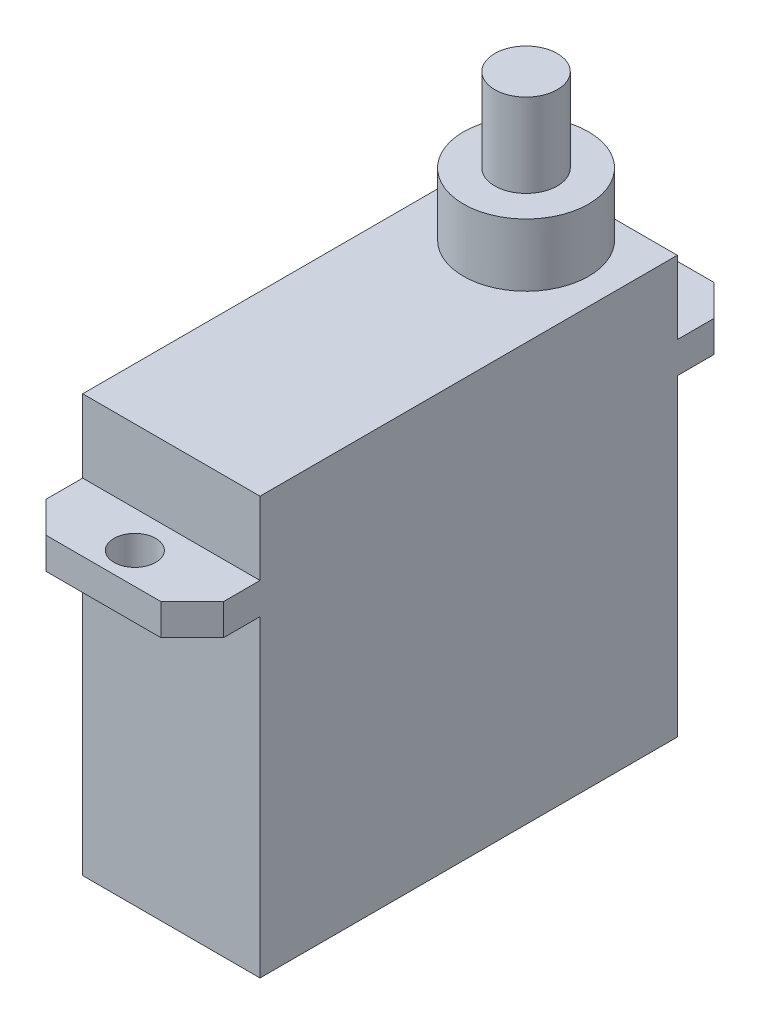
ISO-10303-21;
HEADER;
FILE_DESCRIPTION(('STEP AP214'),'2;1');
FILE_NAME('part.step','',(''),(''),'','','');
FILE_SCHEMA(('AUTOMOTIVE_DESIGN { 1 0 10303 214 1 1 1 1 }'));
ENDSEC;
DATA;
#1=APPLICATION_CONTEXT('core data for automotive mechanical design processes');
#2=APPLICATION_PROTOCOL_DEFINITION('international standard','automotive_design',2000,#1);
#3=PRODUCT_CONTEXT('',#1,'mechanical');
#4=PRODUCT('Part','Part','',(#3));
#5=PRODUCT_RELATED_PRODUCT_CATEGORY('part','',(#4));
#6=PRODUCT_DEFINITION_FORMATION('','',#4);
#7=PRODUCT_DEFINITION_CONTEXT('part definition',#1,'design');
#8=PRODUCT_DEFINITION('design','',#6,#7);
#9=PRODUCT_DEFINITION_SHAPE('','',#8);
#10=(LENGTH_UNIT() NAMED_UNIT(*) SI_UNIT(.MILLI.,.METRE.));
#11=(NAMED_UNIT(*) PLANE_ANGLE_UNIT() SI_UNIT($,.RADIAN.));
#12=(NAMED_UNIT(*) SI_UNIT($,.STERADIAN.) SOLID_ANGLE_UNIT());
#13=UNCERTAINTY_MEASURE_WITH_UNIT(LENGTH_MEASURE(1.E-05),#10,'distance_accuracy_value','');
#14=(GEOMETRIC_REPRESENTATION_CONTEXT(3) GLOBAL_UNCERTAINTY_ASSIGNED_CONTEXT((#13)) GLOBAL_UNIT_ASSIGNED_CONTEXT((#10,
#11,#12)) REPRESENTATION_CONTEXT('',''));
#15=CARTESIAN_POINT('',(0.,0.,0.));
#16=DIRECTION('',(0.,0.,1.));
#17=DIRECTION('',(1.,0.,0.));
#18=AXIS2_PLACEMENT_3D('',#15,#16,#17);
#19=CARTESIAN_POINT('',(-4.25,20.,10.));
#20=DIRECTION('',(0.,0.,-1.));
#21=DIRECTION('',(-1.,0.,0.));
#22=AXIS2_PLACEMENT_3D('',#19,#20,#21);
#23=PLANE('',#22);
#24=DIRECTION('',(-1.,0.,0.));
#25=VECTOR('',#24,1.);
#26=CARTESIAN_POINT('',(-4.25,16.5,10.));
#27=LINE('',#26,#25);
#28=CARTESIAN_POINT('',(4.25,16.5,10.));
#29=VERTEX_POINT('',#28);
#30=CARTESIAN_POINT('',(-4.25,16.5,10.));
#31=VERTEX_POINT('',#30);
#32=EDGE_CURVE('E328',#29,#31,#27,.T.);
#33=ORIENTED_EDGE('',*,*,#32,.F.);
#34=DIRECTION('',(0.,-1.,0.));
#35=VECTOR('',#34,1.);
#36=CARTESIAN_POINT('',(4.25,20.,10.));
#37=LINE('',#36,#35);
#38=CARTESIAN_POINT('',(4.25,20.,10.));
#39=VERTEX_POINT('',#38);
#40=EDGE_CURVE('E197',#39,#29,#37,.T.);
#41=ORIENTED_EDGE('',*,*,#40,.F.);
#42=DIRECTION('',(1.,0.,0.));
#43=VECTOR('',#42,1.);
#44=CARTESIAN_POINT('',(-4.25,20.,10.));
#45=LINE('',#44,#43);
#46=CARTESIAN_POINT('',(-4.25,20.,10.));
#47=VERTEX_POINT('',#46);
#48=EDGE_CURVE('E184',#47,#39,#45,.T.);
#49=ORIENTED_EDGE('',*,*,#48,.F.);
#50=DIRECTION('',(0.,-1.,0.));
#51=VECTOR('',#50,1.);
#52=CARTESIAN_POINT('',(-4.25,20.,10.));
#53=LINE('',#52,#51);
#54=EDGE_CURVE('E201',#47,#31,#53,.T.);
#55=ORIENTED_EDGE('',*,*,#54,.T.);
#56=EDGE_LOOP('',(#33,#41,#49,#55));
#57=FACE_BOUND('',#56,.T.);
#58=ADVANCED_FACE('F46',(#57),#23,.F.);
#59=CARTESIAN_POINT('',(-4.25,20.,-10.));
#60=DIRECTION('',(0.,0.,1.));
#61=DIRECTION('',(1.,0.,0.));
#62=AXIS2_PLACEMENT_3D('',#59,#60,#61);
#63=PLANE('',#62);
#64=DIRECTION('',(1.,0.,0.));
#65=VECTOR('',#64,1.);
#66=CARTESIAN_POINT('',(-4.25,16.5,-10.));
#67=LINE('',#66,#65);
#68=CARTESIAN_POINT('',(-4.25,16.5,-10.));
#69=VERTEX_POINT('',#68);
#70=CARTESIAN_POINT('',(4.25,16.5,-10.));
#71=VERTEX_POINT('',#70);
#72=EDGE_CURVE('E263',#69,#71,#67,.T.);
#73=ORIENTED_EDGE('',*,*,#72,.F.);
#74=DIRECTION('',(0.,-1.,0.));
#75=VECTOR('',#74,1.);
#76=CARTESIAN_POINT('',(-4.25,20.,-10.));
#77=LINE('',#76,#75);
#78=CARTESIAN_POINT('',(-4.25,20.,-10.));
#79=VERTEX_POINT('',#78);
#80=EDGE_CURVE('E177',#79,#69,#77,.T.);
#81=ORIENTED_EDGE('',*,*,#80,.F.);
#82=DIRECTION('',(-1.,0.,0.));
#83=VECTOR('',#82,1.);
#84=CARTESIAN_POINT('',(-4.25,20.,-10.));
#85=LINE('',#84,#83);
#86=CARTESIAN_POINT('',(0.,20.,-10.));
#87=VERTEX_POINT('',#86);
#88=EDGE_CURVE('E172',#87,#79,#85,.T.);
#89=ORIENTED_EDGE('',*,*,#88,.F.);
#90=CARTESIAN_POINT('',(4.25,20.,-10.));
#91=VERTEX_POINT('',#90);
#92=EDGE_CURVE('E162',#91,#87,#85,.T.);
#93=ORIENTED_EDGE('',*,*,#92,.F.);
#94=DIRECTION('',(0.,-1.,0.));
#95=VECTOR('',#94,1.);
#96=CARTESIAN_POINT('',(4.25,20.,-10.));
#97=LINE('',#96,#95);
#98=EDGE_CURVE('E50',#91,#71,#97,.T.);
#99=ORIENTED_EDGE('',*,*,#98,.T.);
#100=EDGE_LOOP('',(#73,#81,#89,#93,#99));
#101=FACE_BOUND('',#100,.T.);
#102=ADVANCED_FACE('F175',(#101),#63,.F.);
#103=CARTESIAN_POINT('',(4.25,20.,10.));
#104=DIRECTION('',(-1.,0.,0.));
#105=DIRECTION('',(0.,0.,1.));
#106=AXIS2_PLACEMENT_3D('',#103,#104,#105);
#107=PLANE('',#106);
#108=DIRECTION('',(0.,0.,-1.));
#109=VECTOR('',#108,1.);
#110=CARTESIAN_POINT('',(4.25,0.,10.));
#111=LINE('',#110,#109);
#112=CARTESIAN_POINT('',(4.25,0.,10.));
#113=VERTEX_POINT('',#112);
#114=CARTESIAN_POINT('',(4.25,0.,-10.));
#115=VERTEX_POINT('',#114);
#116=EDGE_CURVE('E186',#113,#115,#111,.T.);
#117=ORIENTED_EDGE('',*,*,#116,.T.);
#118=CARTESIAN_POINT('',(4.25,15.,-10.));
#119=VERTEX_POINT('',#118);
#120=EDGE_CURVE('E203',#119,#115,#97,.T.);
#121=ORIENTED_EDGE('',*,*,#120,.F.);
#122=DIRECTION('',(0.,0.,-1.));
#123=VECTOR('',#122,1.);
#124=CARTESIAN_POINT('',(4.25,15.,-10.));
#125=LINE('',#124,#123);
#126=CARTESIAN_POINT('',(4.25,15.,-11.75));
#127=VERTEX_POINT('',#126);
#128=EDGE_CURVE('E279',#119,#127,#125,.T.);
#129=ORIENTED_EDGE('',*,*,#128,.T.);
#130=DIRECTION('',(0.,-1.,0.));
#131=VECTOR('',#130,1.);
#132=CARTESIAN_POINT('',(4.25,16.5,-11.75));
#133=LINE('',#132,#131);
#134=CARTESIAN_POINT('',(4.25,16.5,-11.75));
#135=VERTEX_POINT('',#134);
#136=EDGE_CURVE('E190',#135,#127,#133,.T.);
#137=ORIENTED_EDGE('',*,*,#136,.F.);
#138=DIRECTION('',(0.,0.,-1.));
#139=VECTOR('',#138,1.);
#140=CARTESIAN_POINT('',(4.25,16.5,-10.));
#141=LINE('',#140,#139);
#142=EDGE_CURVE('E267',#71,#135,#141,.T.);
#143=ORIENTED_EDGE('',*,*,#142,.F.);
#144=ORIENTED_EDGE('',*,*,#98,.F.);
#145=DIRECTION('',(0.,0.,-1.));
#146=VECTOR('',#145,1.);
#147=CARTESIAN_POINT('',(4.25,20.,10.));
#148=LINE('',#147,#146);
#149=EDGE_CURVE('E168',#39,#91,#148,.T.);
#150=ORIENTED_EDGE('',*,*,#149,.F.);
#151=ORIENTED_EDGE('',*,*,#40,.T.);
#152=DIRECTION('',(0.,0.,-1.));
#153=VECTOR('',#152,1.);
#154=CARTESIAN_POINT('',(4.25,16.5,10.));
#155=LINE('',#154,#153);
#156=CARTESIAN_POINT('',(4.25,16.5,11.75));
#157=VERTEX_POINT('',#156);
#158=EDGE_CURVE('E321',#157,#29,#155,.T.);
#159=ORIENTED_EDGE('',*,*,#158,.F.);
#160=DIRECTION('',(0.,-1.,0.));
#161=VECTOR('',#160,1.);
#162=CARTESIAN_POINT('',(4.25,16.5,11.75));
#163=LINE('',#162,#161);
#164=CARTESIAN_POINT('',(4.25,15.,11.75));
#165=VERTEX_POINT('',#164);
#166=EDGE_CURVE('E245',#157,#165,#163,.T.);
#167=ORIENTED_EDGE('',*,*,#166,.T.);
#168=DIRECTION('',(0.,0.,-1.));
#169=VECTOR('',#168,1.);
#170=CARTESIAN_POINT('',(4.25,15.,10.));
#171=LINE('',#170,#169);
#172=CARTESIAN_POINT('',(4.25,15.,10.));
#173=VERTEX_POINT('',#172);
#174=EDGE_CURVE('E239',#165,#173,#171,.T.);
#175=ORIENTED_EDGE('',*,*,#174,.T.);
#176=EDGE_CURVE('E67',#173,#113,#37,.T.);
#177=ORIENTED_EDGE('',*,*,#176,.T.);
#178=EDGE_LOOP('',(#117,#121,#129,#137,#143,#144,#150,#151,#159,#167,#175,#177));
#179=FACE_BOUND('',#178,.T.);
#180=ADVANCED_FACE('F48',(#179),#107,.F.);
#181=CARTESIAN_POINT('',(-4.25,15.,-10.));
#182=VERTEX_POINT('',#181);
#183=CARTESIAN_POINT('',(-4.25,0.,-10.));
#184=VERTEX_POINT('',#183);
#185=EDGE_CURVE('E202',#182,#184,#77,.T.);
#186=ORIENTED_EDGE('',*,*,#185,.F.);
#187=DIRECTION('',(1.,0.,0.));
#188=VECTOR('',#187,1.);
#189=CARTESIAN_POINT('',(-4.25,15.,-10.));
#190=LINE('',#189,#188);
#191=EDGE_CURVE('E277',#182,#119,#190,.T.);
#192=ORIENTED_EDGE('',*,*,#191,.T.);
#193=ORIENTED_EDGE('',*,*,#120,.T.);
#194=DIRECTION('',(-1.,0.,0.));
#195=VECTOR('',#194,1.);
#196=CARTESIAN_POINT('',(-4.25,0.,-10.));
#197=LINE('',#196,#195);
#198=EDGE_CURVE('E189',#115,#184,#197,.T.);
#199=ORIENTED_EDGE('',*,*,#198,.T.);
#200=EDGE_LOOP('',(#186,#192,#193,#199));
#201=FACE_BOUND('',#200,.T.);
#202=ADVANCED_FACE('F217',(#201),#63,.F.);
#203=CARTESIAN_POINT('',(-4.25,20.,10.));
#204=DIRECTION('',(1.,0.,0.));
#205=DIRECTION('',(0.,0.,-1.));
#206=AXIS2_PLACEMENT_3D('',#203,#204,#205);
#207=PLANE('',#206);
#208=DIRECTION('',(0.,0.,1.));
#209=VECTOR('',#208,1.);
#210=CARTESIAN_POINT('',(-4.25,0.,10.));
#211=LINE('',#210,#209);
#212=CARTESIAN_POINT('',(-4.25,0.,10.));
#213=VERTEX_POINT('',#212);
#214=EDGE_CURVE('E193',#184,#213,#211,.T.);
#215=ORIENTED_EDGE('',*,*,#214,.T.);
#216=CARTESIAN_POINT('',(-4.25,15.,10.));
#217=VERTEX_POINT('',#216);
#218=EDGE_CURVE('E200',#217,#213,#53,.T.);
#219=ORIENTED_EDGE('',*,*,#218,.F.);
#220=DIRECTION('',(0.,0.,1.));
#221=VECTOR('',#220,1.);
#222=CARTESIAN_POINT('',(-4.25,15.,10.));
#223=LINE('',#222,#221);
#224=CARTESIAN_POINT('',(-4.25,15.,11.75));
#225=VERTEX_POINT('',#224);
#226=EDGE_CURVE('E225',#217,#225,#223,.T.);
#227=ORIENTED_EDGE('',*,*,#226,.T.);
#228=DIRECTION('',(0.,-1.,0.));
#229=VECTOR('',#228,1.);
#230=CARTESIAN_POINT('',(-4.25,16.5,11.75));
#231=LINE('',#230,#229);
#232=CARTESIAN_POINT('',(-4.25,16.5,11.75));
#233=VERTEX_POINT('',#232);
#234=EDGE_CURVE('E243',#233,#225,#231,.T.);
#235=ORIENTED_EDGE('',*,*,#234,.F.);
#236=DIRECTION('',(0.,0.,1.));
#237=VECTOR('',#236,1.);
#238=CARTESIAN_POINT('',(-4.25,16.5,10.));
#239=LINE('',#238,#237);
#240=EDGE_CURVE('E246',#31,#233,#239,.T.);
#241=ORIENTED_EDGE('',*,*,#240,.F.);
#242=ORIENTED_EDGE('',*,*,#54,.F.);
#243=DIRECTION('',(0.,0.,1.));
#244=VECTOR('',#243,1.);
#245=CARTESIAN_POINT('',(-4.25,20.,10.));
#246=LINE('',#245,#244);
#247=EDGE_CURVE('E171',#79,#47,#246,.T.);
#248=ORIENTED_EDGE('',*,*,#247,.F.);
#249=ORIENTED_EDGE('',*,*,#80,.T.);
#250=DIRECTION('',(0.,0.,1.));
#251=VECTOR('',#250,1.);
#252=CARTESIAN_POINT('',(-4.25,16.5,-10.));
#253=LINE('',#252,#251);
#254=CARTESIAN_POINT('',(-4.25,16.5,-11.75));
#255=VERTEX_POINT('',#254);
#256=EDGE_CURVE('E261',#255,#69,#253,.T.);
#257=ORIENTED_EDGE('',*,*,#256,.F.);
#258=DIRECTION('',(0.,-1.,0.));
#259=VECTOR('',#258,1.);
#260=CARTESIAN_POINT('',(-4.25,16.5,-11.75));
#261=LINE('',#260,#259);
#262=CARTESIAN_POINT('',(-4.25,15.,-11.75));
#263=VERTEX_POINT('',#262);
#264=EDGE_CURVE('E275',#255,#263,#261,.T.);
#265=ORIENTED_EDGE('',*,*,#264,.T.);
#266=DIRECTION('',(0.,0.,1.));
#267=VECTOR('',#266,1.);
#268=CARTESIAN_POINT('',(-4.25,15.,-10.));
#269=LINE('',#268,#267);
#270=EDGE_CURVE('E213',#263,#182,#269,.T.);
#271=ORIENTED_EDGE('',*,*,#270,.T.);
#272=ORIENTED_EDGE('',*,*,#185,.T.);
#273=EDGE_LOOP('',(#215,#219,#227,#235,#241,#242,#248,#249,#257,#265,#271,#272));
#274=FACE_BOUND('',#273,.T.);
#275=ADVANCED_FACE('F208',(#274),#207,.F.);
#276=ORIENTED_EDGE('',*,*,#176,.F.);
#277=DIRECTION('',(-1.,0.,0.));
#278=VECTOR('',#277,1.);
#279=CARTESIAN_POINT('',(-4.25,15.,10.));
#280=LINE('',#279,#278);
#281=EDGE_CURVE('E62',#173,#217,#280,.T.);
#282=ORIENTED_EDGE('',*,*,#281,.T.);
#283=ORIENTED_EDGE('',*,*,#218,.T.);
#284=DIRECTION('',(1.,0.,0.));
#285=VECTOR('',#284,1.);
#286=CARTESIAN_POINT('',(-4.25,0.,10.));
#287=LINE('',#286,#285);
#288=EDGE_CURVE('E179',#213,#113,#287,.T.);
#289=ORIENTED_EDGE('',*,*,#288,.T.);
#290=EDGE_LOOP('',(#276,#282,#283,#289));
#291=FACE_BOUND('',#290,.T.);
#292=ADVANCED_FACE('F222',(#291),#23,.F.);
#293=CARTESIAN_POINT('',(0.,20.,0.));
#294=DIRECTION('',(0.,-1.,0.));
#295=DIRECTION('',(0.,0.,-1.));
#296=AXIS2_PLACEMENT_3D('',#293,#294,#295);
#297=PLANE('',#296);
#298=ORIENTED_EDGE('',*,*,#92,.T.);
#299=CARTESIAN_POINT('',(0.,20.,-7.));
#300=DIRECTION('',(0.,1.,0.));
#301=DIRECTION('',(0.,0.,1.));
#302=AXIS2_PLACEMENT_3D('',#299,#300,#301);
#303=CIRCLE('',#302,3.);
#304=EDGE_CURVE('E166',#87,#87,#303,.T.);
#305=ORIENTED_EDGE('',*,*,#304,.F.);
#306=ORIENTED_EDGE('',*,*,#88,.T.);
#307=ORIENTED_EDGE('',*,*,#247,.T.);
#308=ORIENTED_EDGE('',*,*,#48,.T.);
#309=ORIENTED_EDGE('',*,*,#149,.T.);
#310=EDGE_LOOP('',(#298,#305,#306,#307,#308,#309));
#311=FACE_BOUND('',#310,.T.);
#312=ADVANCED_FACE('F164',(#311),#297,.F.);
#313=CARTESIAN_POINT('',(0.,0.,0.));
#314=DIRECTION('',(0.,-1.,0.));
#315=DIRECTION('',(0.,0.,-1.));
#316=AXIS2_PLACEMENT_3D('',#313,#314,#315);
#317=PLANE('',#316);
#318=ORIENTED_EDGE('',*,*,#116,.F.);
#319=ORIENTED_EDGE('',*,*,#288,.F.);
#320=ORIENTED_EDGE('',*,*,#214,.F.);
#321=ORIENTED_EDGE('',*,*,#198,.F.);
#322=EDGE_LOOP('',(#318,#319,#320,#321));
#323=FACE_BOUND('',#322,.T.);
#324=ADVANCED_FACE('F221',(#323),#317,.T.);
#325=CARTESIAN_POINT('',(0.,16.5,0.));
#326=DIRECTION('',(0.,-1.,0.));
#327=DIRECTION('',(0.,0.,-1.));
#328=AXIS2_PLACEMENT_3D('',#325,#326,#327);
#329=PLANE('',#328);
#330=ORIENTED_EDGE('',*,*,#256,.T.);
#331=ORIENTED_EDGE('',*,*,#72,.T.);
#332=ORIENTED_EDGE('',*,*,#142,.T.);
#333=DIRECTION('',(-0.707106781186548,0.,-0.707106781186547));
#334=VECTOR('',#333,1.);
#335=CARTESIAN_POINT('',(2.75,16.5,-13.25));
#336=LINE('',#335,#334);
#337=CARTESIAN_POINT('',(2.75,16.5,-13.25));
#338=VERTEX_POINT('',#337);
#339=EDGE_CURVE('E269',#135,#338,#336,.T.);
#340=ORIENTED_EDGE('',*,*,#339,.T.);
#341=DIRECTION('',(-1.,0.,0.));
#342=VECTOR('',#341,1.);
#343=CARTESIAN_POINT('',(-2.75,16.5,-13.25));
#344=LINE('',#343,#342);
#345=CARTESIAN_POINT('',(-2.75,16.5,-13.25));
#346=VERTEX_POINT('',#345);
#347=EDGE_CURVE('E271',#338,#346,#344,.T.);
#348=ORIENTED_EDGE('',*,*,#347,.T.);
#349=DIRECTION('',(-0.707106781186548,0.,0.707106781186547));
#350=VECTOR('',#349,1.);
#351=CARTESIAN_POINT('',(-4.25,16.5,-11.75));
#352=LINE('',#351,#350);
#353=EDGE_CURVE('E273',#346,#255,#352,.T.);
#354=ORIENTED_EDGE('',*,*,#353,.T.);
#355=EDGE_LOOP('',(#330,#331,#332,#340,#348,#354));
#356=FACE_BOUND('',#355,.T.);
#357=CARTESIAN_POINT('',(0.,16.5,-11.75));
#358=DIRECTION('',(0.,1.,0.));
#359=DIRECTION('',(0.,0.,1.));
#360=AXIS2_PLACEMENT_3D('',#357,#358,#359);
#361=CIRCLE('',#360,1.);
#362=CARTESIAN_POINT('',(0.,16.5,-10.75));
#363=VERTEX_POINT('',#362);
#364=EDGE_CURVE('E256',#363,#363,#361,.T.);
#365=ORIENTED_EDGE('',*,*,#364,.F.);
#366=EDGE_LOOP('',(#365));
#367=FACE_BOUND('',#366,.T.);
#368=ADVANCED_FACE('F316',(#356,#367),#329,.F.);
#369=CARTESIAN_POINT('',(0.,15.,0.));
#370=DIRECTION('',(0.,-1.,0.));
#371=DIRECTION('',(0.,0.,-1.));
#372=AXIS2_PLACEMENT_3D('',#369,#370,#371);
#373=PLANE('',#372);
#374=ORIENTED_EDGE('',*,*,#270,.F.);
#375=DIRECTION('',(-0.707106781186548,0.,0.707106781186547));
#376=VECTOR('',#375,1.);
#377=CARTESIAN_POINT('',(-4.25,15.,-11.75));
#378=LINE('',#377,#376);
#379=CARTESIAN_POINT('',(-2.75,15.,-13.25));
#380=VERTEX_POINT('',#379);
#381=EDGE_CURVE('E264',#380,#263,#378,.T.);
#382=ORIENTED_EDGE('',*,*,#381,.F.);
#383=DIRECTION('',(-1.,0.,0.));
#384=VECTOR('',#383,1.);
#385=CARTESIAN_POINT('',(-2.75,15.,-13.25));
#386=LINE('',#385,#384);
#387=CARTESIAN_POINT('',(2.75,15.,-13.25));
#388=VERTEX_POINT('',#387);
#389=EDGE_CURVE('E283',#388,#380,#386,.T.);
#390=ORIENTED_EDGE('',*,*,#389,.F.);
#391=DIRECTION('',(-0.707106781186548,0.,-0.707106781186547));
#392=VECTOR('',#391,1.);
#393=CARTESIAN_POINT('',(2.75,15.,-13.25));
#394=LINE('',#393,#392);
#395=EDGE_CURVE('E281',#127,#388,#394,.T.);
#396=ORIENTED_EDGE('',*,*,#395,.F.);
#397=ORIENTED_EDGE('',*,*,#128,.F.);
#398=ORIENTED_EDGE('',*,*,#191,.F.);
#399=EDGE_LOOP('',(#374,#382,#390,#396,#397,#398));
#400=FACE_BOUND('',#399,.T.);
#401=CARTESIAN_POINT('',(0.,15.,-11.75));
#402=DIRECTION('',(0.,1.,0.));
#403=DIRECTION('',(0.,0.,1.));
#404=AXIS2_PLACEMENT_3D('',#401,#402,#403);
#405=CIRCLE('',#404,1.);
#406=CARTESIAN_POINT('',(0.,15.,-10.75));
#407=VERTEX_POINT('',#406);
#408=EDGE_CURVE('E255',#407,#407,#405,.T.);
#409=ORIENTED_EDGE('',*,*,#408,.T.);
#410=EDGE_LOOP('',(#409));
#411=FACE_BOUND('',#410,.T.);
#412=ADVANCED_FACE('F304',(#400,#411),#373,.T.);
#413=CARTESIAN_POINT('',(2.75,16.5,-13.25));
#414=DIRECTION('',(-0.707106781186547,0.,0.707106781186548));
#415=DIRECTION('',(0.707106781186548,0.,0.707106781186547));
#416=AXIS2_PLACEMENT_3D('',#413,#414,#415);
#417=PLANE('',#416);
#418=ORIENTED_EDGE('',*,*,#395,.T.);
#419=DIRECTION('',(0.,-1.,0.));
#420=VECTOR('',#419,1.);
#421=CARTESIAN_POINT('',(2.75,16.5,-13.25));
#422=LINE('',#421,#420);
#423=EDGE_CURVE('E290',#338,#388,#422,.T.);
#424=ORIENTED_EDGE('',*,*,#423,.F.);
#425=ORIENTED_EDGE('',*,*,#339,.F.);
#426=ORIENTED_EDGE('',*,*,#136,.T.);
#427=EDGE_LOOP('',(#418,#424,#425,#426));
#428=FACE_BOUND('',#427,.T.);
#429=ADVANCED_FACE('F297',(#428),#417,.F.);
#430=CARTESIAN_POINT('',(-2.75,16.5,-13.25));
#431=DIRECTION('',(0.,0.,1.));
#432=DIRECTION('',(1.,0.,0.));
#433=AXIS2_PLACEMENT_3D('',#430,#431,#432);
#434=PLANE('',#433);
#435=ORIENTED_EDGE('',*,*,#389,.T.);
#436=DIRECTION('',(0.,-1.,0.));
#437=VECTOR('',#436,1.);
#438=CARTESIAN_POINT('',(-2.75,16.5,-13.25));
#439=LINE('',#438,#437);
#440=EDGE_CURVE('E287',#346,#380,#439,.T.);
#441=ORIENTED_EDGE('',*,*,#440,.F.);
#442=ORIENTED_EDGE('',*,*,#347,.F.);
#443=ORIENTED_EDGE('',*,*,#423,.T.);
#444=EDGE_LOOP('',(#435,#441,#442,#443));
#445=FACE_BOUND('',#444,.T.);
#446=ADVANCED_FACE('F309',(#445),#434,.F.);
#447=CARTESIAN_POINT('',(-4.25,16.5,-11.75));
#448=DIRECTION('',(0.707106781186547,0.,0.707106781186548));
#449=DIRECTION('',(0.707106781186548,0.,-0.707106781186547));
#450=AXIS2_PLACEMENT_3D('',#447,#448,#449);
#451=PLANE('',#450);
#452=ORIENTED_EDGE('',*,*,#381,.T.);
#453=ORIENTED_EDGE('',*,*,#264,.F.);
#454=ORIENTED_EDGE('',*,*,#353,.F.);
#455=ORIENTED_EDGE('',*,*,#440,.T.);
#456=EDGE_LOOP('',(#452,#453,#454,#455));
#457=FACE_BOUND('',#456,.T.);
#458=ADVANCED_FACE('F313',(#457),#451,.F.);
#459=CARTESIAN_POINT('',(0.,16.5,-11.75));
#460=DIRECTION('',(0.,-1.,0.));
#461=DIRECTION('',(0.,0.,-1.));
#462=AXIS2_PLACEMENT_3D('',#459,#460,#461);
#463=CYLINDRICAL_SURFACE('',#462,1.);
#464=ORIENTED_EDGE('',*,*,#364,.T.);
#465=EDGE_LOOP('',(#464));
#466=FACE_BOUND('',#465,.T.);
#467=ORIENTED_EDGE('',*,*,#408,.F.);
#468=EDGE_LOOP('',(#467));
#469=FACE_BOUND('',#468,.T.);
#470=ADVANCED_FACE('F495',(#466,#469),#463,.F.);
#471=CARTESIAN_POINT('',(0.,16.5,0.));
#472=DIRECTION('',(0.,1.,0.));
#473=DIRECTION('',(0.,0.,1.));
#474=AXIS2_PLACEMENT_3D('',#471,#472,#473);
#475=PLANE('',#474);
#476=DIRECTION('',(0.707106781186548,0.,0.707106781186547));
#477=VECTOR('',#476,1.);
#478=CARTESIAN_POINT('',(-4.25,16.5,11.75));
#479=LINE('',#478,#477);
#480=CARTESIAN_POINT('',(-2.75,16.5,13.25));
#481=VERTEX_POINT('',#480);
#482=EDGE_CURVE('E234',#233,#481,#479,.T.);
#483=ORIENTED_EDGE('',*,*,#482,.T.);
#484=DIRECTION('',(1.,0.,0.));
#485=VECTOR('',#484,1.);
#486=CARTESIAN_POINT('',(-2.75,16.5,13.25));
#487=LINE('',#486,#485);
#488=CARTESIAN_POINT('',(2.75,16.5,13.25));
#489=VERTEX_POINT('',#488);
#490=EDGE_CURVE('E237',#481,#489,#487,.T.);
#491=ORIENTED_EDGE('',*,*,#490,.T.);
#492=DIRECTION('',(0.707106781186548,0.,-0.707106781186547));
#493=VECTOR('',#492,1.);
#494=CARTESIAN_POINT('',(2.75,16.5,13.25));
#495=LINE('',#494,#493);
#496=EDGE_CURVE('E331',#489,#157,#495,.T.);
#497=ORIENTED_EDGE('',*,*,#496,.T.);
#498=ORIENTED_EDGE('',*,*,#158,.T.);
#499=ORIENTED_EDGE('',*,*,#32,.T.);
#500=ORIENTED_EDGE('',*,*,#240,.T.);
#501=EDGE_LOOP('',(#483,#491,#497,#498,#499,#500));
#502=FACE_BOUND('',#501,.T.);
#503=CARTESIAN_POINT('',(0.,16.5,11.75));
#504=DIRECTION('',(0.,1.,0.));
#505=DIRECTION('',(0.,0.,-1.));
#506=AXIS2_PLACEMENT_3D('',#503,#504,#505);
#507=CIRCLE('',#506,1.);
#508=CARTESIAN_POINT('',(0.,16.5,10.75));
#509=VERTEX_POINT('',#508);
#510=EDGE_CURVE('E341',#509,#509,#507,.T.);
#511=ORIENTED_EDGE('',*,*,#510,.F.);
#512=EDGE_LOOP('',(#511));
#513=FACE_BOUND('',#512,.T.);
#514=ADVANCED_FACE('F326',(#502,#513),#475,.T.);
#515=CARTESIAN_POINT('',(0.,15.,0.));
#516=DIRECTION('',(0.,1.,0.));
#517=DIRECTION('',(0.,0.,1.));
#518=AXIS2_PLACEMENT_3D('',#515,#516,#517);
#519=PLANE('',#518);
#520=DIRECTION('',(0.707106781186548,0.,0.707106781186547));
#521=VECTOR('',#520,1.);
#522=CARTESIAN_POINT('',(-4.25,15.,11.75));
#523=LINE('',#522,#521);
#524=CARTESIAN_POINT('',(-2.75,15.,13.25));
#525=VERTEX_POINT('',#524);
#526=EDGE_CURVE('E233',#225,#525,#523,.T.);
#527=ORIENTED_EDGE('',*,*,#526,.F.);
#528=ORIENTED_EDGE('',*,*,#226,.F.);
#529=ORIENTED_EDGE('',*,*,#281,.F.);
#530=ORIENTED_EDGE('',*,*,#174,.F.);
#531=DIRECTION('',(0.707106781186548,0.,-0.707106781186547));
#532=VECTOR('',#531,1.);
#533=CARTESIAN_POINT('',(2.75,15.,13.25));
#534=LINE('',#533,#532);
#535=CARTESIAN_POINT('',(2.75,15.,13.25));
#536=VERTEX_POINT('',#535);
#537=EDGE_CURVE('E343',#536,#165,#534,.T.);
#538=ORIENTED_EDGE('',*,*,#537,.F.);
#539=DIRECTION('',(1.,0.,0.));
#540=VECTOR('',#539,1.);
#541=CARTESIAN_POINT('',(-2.75,15.,13.25));
#542=LINE('',#541,#540);
#543=EDGE_CURVE('E340',#525,#536,#542,.T.);
#544=ORIENTED_EDGE('',*,*,#543,.F.);
#545=EDGE_LOOP('',(#527,#528,#529,#530,#538,#544));
#546=FACE_BOUND('',#545,.T.);
#547=CARTESIAN_POINT('',(0.,15.,11.75));
#548=DIRECTION('',(0.,1.,0.));
#549=DIRECTION('',(0.,0.,-1.));
#550=AXIS2_PLACEMENT_3D('',#547,#548,#549);
#551=CIRCLE('',#550,1.);
#552=CARTESIAN_POINT('',(0.,15.,10.75));
#553=VERTEX_POINT('',#552);
#554=EDGE_CURVE('E356',#553,#553,#551,.T.);
#555=ORIENTED_EDGE('',*,*,#554,.T.);
#556=EDGE_LOOP('',(#555));
#557=FACE_BOUND('',#556,.T.);
#558=ADVANCED_FACE('F229',(#546,#557),#519,.F.);
#559=CARTESIAN_POINT('',(-4.25,16.5,11.75));
#560=DIRECTION('',(0.707106781186547,0.,-0.707106781186548));
#561=DIRECTION('',(-0.707106781186548,0.,-0.707106781186547));
#562=AXIS2_PLACEMENT_3D('',#559,#560,#561);
#563=PLANE('',#562);
#564=ORIENTED_EDGE('',*,*,#526,.T.);
#565=DIRECTION('',(0.,-1.,0.));
#566=VECTOR('',#565,1.);
#567=CARTESIAN_POINT('',(-2.75,16.5,13.25));
#568=LINE('',#567,#566);
#569=EDGE_CURVE('E252',#481,#525,#568,.T.);
#570=ORIENTED_EDGE('',*,*,#569,.F.);
#571=ORIENTED_EDGE('',*,*,#482,.F.);
#572=ORIENTED_EDGE('',*,*,#234,.T.);
#573=EDGE_LOOP('',(#564,#570,#571,#572));
#574=FACE_BOUND('',#573,.T.);
#575=ADVANCED_FACE('F353',(#574),#563,.F.);
#576=CARTESIAN_POINT('',(-2.75,16.5,13.25));
#577=DIRECTION('',(0.,0.,-1.));
#578=DIRECTION('',(-1.,0.,0.));
#579=AXIS2_PLACEMENT_3D('',#576,#577,#578);
#580=PLANE('',#579);
#581=ORIENTED_EDGE('',*,*,#543,.T.);
#582=DIRECTION('',(0.,-1.,0.));
#583=VECTOR('',#582,1.);
#584=CARTESIAN_POINT('',(2.75,16.5,13.25));
#585=LINE('',#584,#583);
#586=EDGE_CURVE('E249',#489,#536,#585,.T.);
#587=ORIENTED_EDGE('',*,*,#586,.F.);
#588=ORIENTED_EDGE('',*,*,#490,.F.);
#589=ORIENTED_EDGE('',*,*,#569,.T.);
#590=EDGE_LOOP('',(#581,#587,#588,#589));
#591=FACE_BOUND('',#590,.T.);
#592=ADVANCED_FACE('F349',(#591),#580,.F.);
#593=CARTESIAN_POINT('',(2.75,16.5,13.25));
#594=DIRECTION('',(-0.707106781186547,0.,-0.707106781186548));
#595=DIRECTION('',(-0.707106781186548,0.,0.707106781186547));
#596=AXIS2_PLACEMENT_3D('',#593,#594,#595);
#597=PLANE('',#596);
#598=ORIENTED_EDGE('',*,*,#537,.T.);
#599=ORIENTED_EDGE('',*,*,#166,.F.);
#600=ORIENTED_EDGE('',*,*,#496,.F.);
#601=ORIENTED_EDGE('',*,*,#586,.T.);
#602=EDGE_LOOP('',(#598,#599,#600,#601));
#603=FACE_BOUND('',#602,.T.);
#604=ADVANCED_FACE('F346',(#603),#597,.F.);
#605=CARTESIAN_POINT('',(0.,16.5,11.75));
#606=DIRECTION('',(0.,-1.,0.));
#607=DIRECTION('',(0.,0.,-1.));
#608=AXIS2_PLACEMENT_3D('',#605,#606,#607);
#609=CYLINDRICAL_SURFACE('',#608,1.);
#610=ORIENTED_EDGE('',*,*,#510,.T.);
#611=EDGE_LOOP('',(#610));
#612=FACE_BOUND('',#611,.T.);
#613=ORIENTED_EDGE('',*,*,#554,.F.);
#614=EDGE_LOOP('',(#613));
#615=FACE_BOUND('',#614,.T.);
#616=ADVANCED_FACE('F386',(#612,#615),#609,.F.);
#617=CARTESIAN_POINT('',(0.,23.,-7.));
#618=DIRECTION('',(0.,-1.,0.));
#619=DIRECTION('',(0.,0.,-1.));
#620=AXIS2_PLACEMENT_3D('',#617,#618,#619);
#621=CYLINDRICAL_SURFACE('',#620,3.);
#622=CARTESIAN_POINT('',(0.,23.,-7.));
#623=DIRECTION('',(0.,1.,0.));
#624=DIRECTION('',(0.,0.,1.));
#625=AXIS2_PLACEMENT_3D('',#622,#623,#624);
#626=CIRCLE('',#625,3.);
#627=CARTESIAN_POINT('',(0.,23.,-4.));
#628=VERTEX_POINT('',#627);
#629=EDGE_CURVE('E359',#628,#628,#626,.T.);
#630=ORIENTED_EDGE('',*,*,#629,.F.);
#631=EDGE_LOOP('',(#630));
#632=FACE_BOUND('',#631,.T.);
#633=ORIENTED_EDGE('',*,*,#304,.T.);
#634=EDGE_LOOP('',(#633));
#635=FACE_BOUND('',#634,.T.);
#636=ADVANCED_FACE('F380',(#632,#635),#621,.T.);
#637=CARTESIAN_POINT('',(0.,23.,-7.));
#638=DIRECTION('',(0.,1.,0.));
#639=DIRECTION('',(0.,0.,1.));
#640=AXIS2_PLACEMENT_3D('',#637,#638,#639);
#641=PLANE('',#640);
#642=CARTESIAN_POINT('',(0.,23.,-7.));
#643=DIRECTION('',(0.,1.,0.));
#644=DIRECTION('',(0.,0.,1.));
#645=AXIS2_PLACEMENT_3D('',#642,#643,#644);
#646=CIRCLE('',#645,1.5);
#647=CARTESIAN_POINT('',(0.,23.,-5.5));
#648=VERTEX_POINT('',#647);
#649=EDGE_CURVE('E13',#648,#648,#646,.T.);
#650=ORIENTED_EDGE('',*,*,#649,.F.);
#651=EDGE_LOOP('',(#650));
#652=FACE_BOUND('',#651,.T.);
#653=ORIENTED_EDGE('',*,*,#629,.T.);
#654=EDGE_LOOP('',(#653));
#655=FACE_BOUND('',#654,.T.);
#656=ADVANCED_FACE('F374',(#652,#655),#641,.T.);
#657=CARTESIAN_POINT('',(0.,27.,-7.));
#658=DIRECTION('',(0.,-1.,0.));
#659=DIRECTION('',(0.,0.,-1.));
#660=AXIS2_PLACEMENT_3D('',#657,#658,#659);
#661=CYLINDRICAL_SURFACE('',#660,1.5);
#662=CARTESIAN_POINT('',(0.,27.,-7.));
#663=DIRECTION('',(0.,1.,0.));
#664=DIRECTION('',(0.,0.,1.));
#665=AXIS2_PLACEMENT_3D('',#662,#663,#664);
#666=CIRCLE('',#665,1.5);
#667=CARTESIAN_POINT('',(0.,27.,-5.5));
#668=VERTEX_POINT('',#667);
#669=EDGE_CURVE('E363',#668,#668,#666,.T.);
#670=ORIENTED_EDGE('',*,*,#669,.F.);
#671=EDGE_LOOP('',(#670));
#672=FACE_BOUND('',#671,.T.);
#673=ORIENTED_EDGE('',*,*,#649,.T.);
#674=EDGE_LOOP('',(#673));
#675=FACE_BOUND('',#674,.T.);
#676=ADVANCED_FACE('F371',(#672,#675),#661,.T.);
#677=CARTESIAN_POINT('',(0.,27.,-7.));
#678=DIRECTION('',(0.,1.,0.));
#679=DIRECTION('',(0.,0.,1.));
#680=AXIS2_PLACEMENT_3D('',#677,#678,#679);
#681=PLANE('',#680);
#682=ORIENTED_EDGE('',*,*,#669,.T.);
#683=EDGE_LOOP('',(#682));
#684=FACE_BOUND('',#683,.T.);
#685=ADVANCED_FACE('F369',(#684),#681,.T.);
#686=CLOSED_SHELL('',(#58,#102,#180,#202,#275,#292,#312,#324,#368,#412,#429,#446,#458,#470,#514,
#558,#575,#592,#604,#616,#636,#656,#676,#685));
#687=MANIFOLD_SOLID_BREP('B2',#686);
#688=ADVANCED_BREP_SHAPE_REPRESENTATION('',(#18,#687),#14);
#689=SHAPE_DEFINITION_REPRESENTATION(#9,#688);
ENDSEC;
END-ISO-10303-21;
